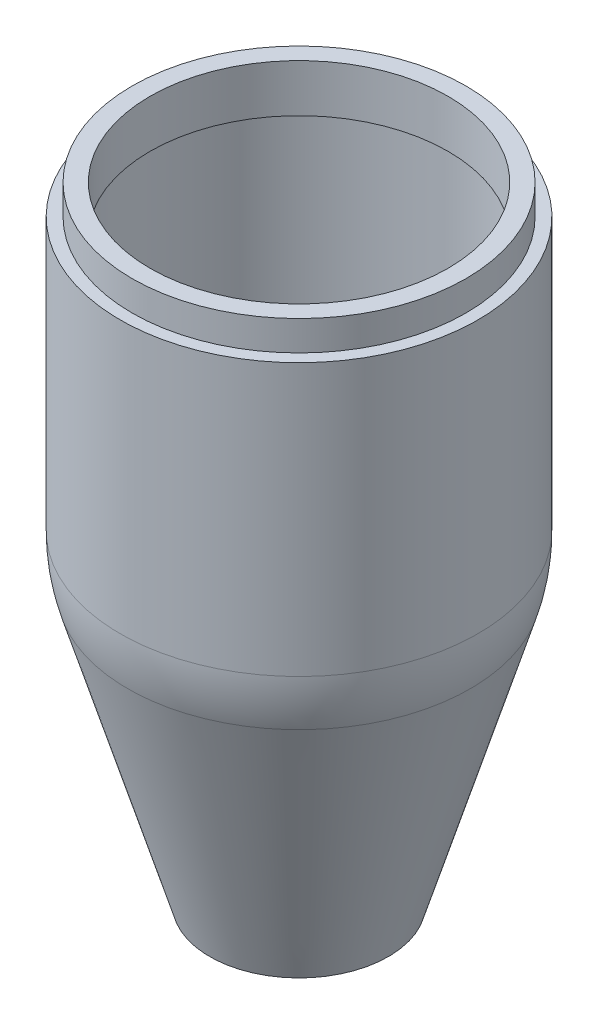
ISO-10303-21;
HEADER;
FILE_DESCRIPTION(('STEP AP214'),'2;1');
FILE_NAME('part.step','',(''),(''),'','','');
FILE_SCHEMA(('AUTOMOTIVE_DESIGN { 1 0 10303 214 1 1 1 1 }'));
ENDSEC;
DATA;
#1=APPLICATION_CONTEXT('core data for automotive mechanical design processes');
#2=APPLICATION_PROTOCOL_DEFINITION('international standard','automotive_design',2000,#1);
#3=PRODUCT_CONTEXT('',#1,'mechanical');
#4=PRODUCT('Part','Part','',(#3));
#5=PRODUCT_RELATED_PRODUCT_CATEGORY('part','',(#4));
#6=PRODUCT_DEFINITION_FORMATION('','',#4);
#7=PRODUCT_DEFINITION_CONTEXT('part definition',#1,'design');
#8=PRODUCT_DEFINITION('design','',#6,#7);
#9=PRODUCT_DEFINITION_SHAPE('','',#8);
#10=(LENGTH_UNIT() NAMED_UNIT(*) SI_UNIT(.MILLI.,.METRE.));
#11=(NAMED_UNIT(*) PLANE_ANGLE_UNIT() SI_UNIT($,.RADIAN.));
#12=(NAMED_UNIT(*) SI_UNIT($,.STERADIAN.) SOLID_ANGLE_UNIT());
#13=UNCERTAINTY_MEASURE_WITH_UNIT(LENGTH_MEASURE(1.E-05),#10,'distance_accuracy_value','');
#14=(GEOMETRIC_REPRESENTATION_CONTEXT(3) GLOBAL_UNCERTAINTY_ASSIGNED_CONTEXT((#13)) GLOBAL_UNIT_ASSIGNED_CONTEXT((#10,
#11,#12)) REPRESENTATION_CONTEXT('',''));
#15=CARTESIAN_POINT('',(0.,0.,0.));
#16=DIRECTION('',(0.,0.,1.));
#17=DIRECTION('',(1.,0.,0.));
#18=AXIS2_PLACEMENT_3D('',#15,#16,#17);
#19=CARTESIAN_POINT('',(0.,0.,0.));
#20=DIRECTION('',(0.,-1.,0.));
#21=DIRECTION('',(0.,0.,-1.));
#22=AXIS2_PLACEMENT_3D('',#19,#20,#21);
#23=PLANE('',#22);
#24=CARTESIAN_POINT('',(0.,0.,0.));
#25=DIRECTION('',(0.,-1.,0.));
#26=DIRECTION('',(0.,0.,-1.));
#27=AXIS2_PLACEMENT_3D('',#24,#25,#26);
#28=CIRCLE('',#27,15.);
#29=CARTESIAN_POINT('',(0.,0.,-15.));
#30=VERTEX_POINT('',#29);
#31=EDGE_CURVE('E55',#30,#30,#28,.T.);
#32=ORIENTED_EDGE('',*,*,#31,.T.);
#33=EDGE_LOOP('',(#32));
#34=FACE_BOUND('',#33,.T.);
#35=ADVANCED_FACE('F41',(#34),#23,.T.);
#36=CARTESIAN_POINT('',(0.,100.,0.));
#37=DIRECTION('',(0.,1.,0.));
#38=DIRECTION('',(0.,0.,1.));
#39=AXIS2_PLACEMENT_3D('',#36,#37,#38);
#40=PLANE('',#39);
#41=CARTESIAN_POINT('',(0.,100.,0.));
#42=DIRECTION('',(0.,1.,0.));
#43=DIRECTION('',(0.,0.,1.));
#44=AXIS2_PLACEMENT_3D('',#41,#42,#43);
#45=CIRCLE('',#44,28.);
#46=CARTESIAN_POINT('',(0.,100.,28.));
#47=VERTEX_POINT('',#46);
#48=EDGE_CURVE('E61',#47,#47,#45,.T.);
#49=ORIENTED_EDGE('',*,*,#48,.F.);
#50=EDGE_LOOP('',(#49));
#51=FACE_BOUND('',#50,.T.);
#52=CARTESIAN_POINT('',(0.,100.,0.));
#53=DIRECTION('',(0.,-1.,0.));
#54=DIRECTION('',(0.,0.,-1.));
#55=AXIS2_PLACEMENT_3D('',#52,#53,#54);
#56=CIRCLE('',#55,30.);
#57=CARTESIAN_POINT('',(0.,100.,-30.));
#58=VERTEX_POINT('',#57);
#59=EDGE_CURVE('E11',#58,#58,#56,.T.);
#60=ORIENTED_EDGE('',*,*,#59,.F.);
#61=EDGE_LOOP('',(#60));
#62=FACE_BOUND('',#61,.T.);
#63=ADVANCED_FACE('F103',(#51,#62),#40,.T.);
#64=CARTESIAN_POINT('',(0.,0.,0.));
#65=DIRECTION('',(0.,-1.,0.));
#66=DIRECTION('',(0.,0.,-1.));
#67=AXIS2_PLACEMENT_3D('',#64,#65,#66);
#68=CYLINDRICAL_SURFACE('',#67,30.);
#69=ORIENTED_EDGE('',*,*,#59,.T.);
#70=EDGE_LOOP('',(#69));
#71=FACE_BOUND('',#70,.T.);
#72=CARTESIAN_POINT('',(0.,54.4030650891056,0.));
#73=DIRECTION('',(0.,-1.,0.));
#74=DIRECTION('',(0.,0.,-1.));
#75=AXIS2_PLACEMENT_3D('',#72,#73,#74);
#76=CIRCLE('',#75,30.);
#77=CARTESIAN_POINT('',(0.,54.4030650891056,-30.));
#78=VERTEX_POINT('',#77);
#79=EDGE_CURVE('E47',#78,#78,#76,.T.);
#80=ORIENTED_EDGE('',*,*,#79,.F.);
#81=EDGE_LOOP('',(#80));
#82=FACE_BOUND('',#81,.T.);
#83=ADVANCED_FACE('F108',(#71,#82),#68,.T.);
#84=CARTESIAN_POINT('',(0.,54.4030650891055,0.));
#85=DIRECTION('',(0.,-1.,0.));
#86=DIRECTION('',(1.,0.,0.));
#87=AXIS2_PLACEMENT_3D('',#84,#85,#86);
#88=SPHERICAL_SURFACE('',#87,30.);
#89=ORIENTED_EDGE('',*,*,#79,.T.);
#90=EDGE_LOOP('',(#89));
#91=FACE_BOUND('',#90,.T.);
#92=CARTESIAN_POINT('',(0.,45.782628522115,0.));
#93=DIRECTION('',(0.,-1.,0.));
#94=DIRECTION('',(0.,0.,-1.));
#95=AXIS2_PLACEMENT_3D('',#92,#93,#94);
#96=CIRCLE('',#95,28.7347885566345);
#97=CARTESIAN_POINT('',(0.,45.782628522115,-28.7347885566345));
#98=VERTEX_POINT('',#97);
#99=EDGE_CURVE('E51',#98,#98,#96,.T.);
#100=ORIENTED_EDGE('',*,*,#99,.F.);
#101=EDGE_LOOP('',(#100));
#102=FACE_BOUND('',#101,.T.);
#103=ADVANCED_FACE('F115',(#91,#102),#88,.T.);
#104=CARTESIAN_POINT('',(0.,0.,0.));
#105=DIRECTION('',(0.,1.,0.));
#106=DIRECTION('',(0.,0.,1.));
#107=AXIS2_PLACEMENT_3D('',#104,#105,#106);
#108=CONICAL_SURFACE('',#107,15.,0.291456794477867);
#109=ORIENTED_EDGE('',*,*,#99,.T.);
#110=EDGE_LOOP('',(#109));
#111=FACE_BOUND('',#110,.T.);
#112=ORIENTED_EDGE('',*,*,#31,.F.);
#113=EDGE_LOOP('',(#112));
#114=FACE_BOUND('',#113,.T.);
#115=ADVANCED_FACE('F112',(#111,#114),#108,.T.);
#116=CARTESIAN_POINT('',(0.,105.,0.));
#117=DIRECTION('',(0.,1.,0.));
#118=DIRECTION('',(0.,0.,1.));
#119=AXIS2_PLACEMENT_3D('',#116,#117,#118);
#120=PLANE('',#119);
#121=CARTESIAN_POINT('',(0.,105.,0.));
#122=DIRECTION('',(0.,1.,0.));
#123=DIRECTION('',(0.,0.,1.));
#124=AXIS2_PLACEMENT_3D('',#121,#122,#123);
#125=CIRCLE('',#124,28.);
#126=CARTESIAN_POINT('',(0.,105.,28.));
#127=VERTEX_POINT('',#126);
#128=EDGE_CURVE('E60',#127,#127,#125,.T.);
#129=ORIENTED_EDGE('',*,*,#128,.T.);
#130=EDGE_LOOP('',(#129));
#131=FACE_BOUND('',#130,.T.);
#132=CARTESIAN_POINT('',(0.,105.,0.));
#133=DIRECTION('',(0.,1.,0.));
#134=DIRECTION('',(1.,0.,0.));
#135=AXIS2_PLACEMENT_3D('',#132,#133,#134);
#136=CIRCLE('',#135,25.);
#137=CARTESIAN_POINT('',(25.,105.,0.));
#138=VERTEX_POINT('',#137);
#139=EDGE_CURVE('E64',#138,#138,#136,.T.);
#140=ORIENTED_EDGE('',*,*,#139,.F.);
#141=EDGE_LOOP('',(#140));
#142=FACE_BOUND('',#141,.T.);
#143=ADVANCED_FACE('F114',(#131,#142),#120,.T.);
#144=CARTESIAN_POINT('',(0.,105.,0.));
#145=DIRECTION('',(0.,-1.,0.));
#146=DIRECTION('',(0.,0.,-1.));
#147=AXIS2_PLACEMENT_3D('',#144,#145,#146);
#148=CYLINDRICAL_SURFACE('',#147,28.);
#149=ORIENTED_EDGE('',*,*,#128,.F.);
#150=EDGE_LOOP('',(#149));
#151=FACE_BOUND('',#150,.T.);
#152=ORIENTED_EDGE('',*,*,#48,.T.);
#153=EDGE_LOOP('',(#152));
#154=FACE_BOUND('',#153,.T.);
#155=ADVANCED_FACE('F99',(#151,#154),#148,.T.);
#156=CARTESIAN_POINT('',(0.,105.,0.));
#157=DIRECTION('',(0.,-1.,0.));
#158=DIRECTION('',(0.,0.,-1.));
#159=AXIS2_PLACEMENT_3D('',#156,#157,#158);
#160=CYLINDRICAL_SURFACE('',#159,25.);
#161=ORIENTED_EDGE('',*,*,#139,.T.);
#162=EDGE_LOOP('',(#161));
#163=FACE_BOUND('',#162,.T.);
#164=CARTESIAN_POINT('',(0.,97.,0.));
#165=DIRECTION('',(0.,1.,0.));
#166=DIRECTION('',(0.,0.,1.));
#167=AXIS2_PLACEMENT_3D('',#164,#165,#166);
#168=CIRCLE('',#167,25.);
#169=CARTESIAN_POINT('',(0.,97.,25.));
#170=VERTEX_POINT('',#169);
#171=EDGE_CURVE('E70',#170,#170,#168,.T.);
#172=ORIENTED_EDGE('',*,*,#171,.F.);
#173=EDGE_LOOP('',(#172));
#174=FACE_BOUND('',#173,.T.);
#175=ADVANCED_FACE('F90',(#163,#174),#160,.F.);
#176=CARTESIAN_POINT('',(0.,3.,0.));
#177=DIRECTION('',(0.,-1.,0.));
#178=DIRECTION('',(0.,0.,-1.));
#179=AXIS2_PLACEMENT_3D('',#176,#177,#178);
#180=PLANE('',#179);
#181=CARTESIAN_POINT('',(0.,3.,0.));
#182=DIRECTION('',(0.,-1.,0.));
#183=DIRECTION('',(0.,0.,-1.));
#184=AXIS2_PLACEMENT_3D('',#181,#182,#183);
#185=CIRCLE('',#184,12.7679080473268);
#186=CARTESIAN_POINT('',(0.,3.,-12.7679080473268));
#187=VERTEX_POINT('',#186);
#188=EDGE_CURVE('E73',#187,#187,#185,.T.);
#189=ORIENTED_EDGE('',*,*,#188,.F.);
#190=EDGE_LOOP('',(#189));
#191=FACE_BOUND('',#190,.T.);
#192=ADVANCED_FACE('F87',(#191),#180,.F.);
#193=CARTESIAN_POINT('',(0.,97.,0.));
#194=DIRECTION('',(0.,1.,0.));
#195=DIRECTION('',(0.,0.,1.));
#196=AXIS2_PLACEMENT_3D('',#193,#194,#195);
#197=PLANE('',#196);
#198=ORIENTED_EDGE('',*,*,#171,.T.);
#199=EDGE_LOOP('',(#198));
#200=FACE_BOUND('',#199,.T.);
#201=CARTESIAN_POINT('',(0.,97.,0.));
#202=DIRECTION('',(0.,1.,0.));
#203=DIRECTION('',(0.,0.,1.));
#204=AXIS2_PLACEMENT_3D('',#201,#202,#203);
#205=CIRCLE('',#204,27.);
#206=CARTESIAN_POINT('',(0.,97.,27.));
#207=VERTEX_POINT('',#206);
#208=EDGE_CURVE('E69',#207,#207,#205,.F.);
#209=ORIENTED_EDGE('',*,*,#208,.T.);
#210=EDGE_LOOP('',(#209));
#211=FACE_BOUND('',#210,.T.);
#212=ADVANCED_FACE('F89',(#200,#211),#197,.F.);
#213=CARTESIAN_POINT('',(0.,0.,0.));
#214=DIRECTION('',(0.,-1.,0.));
#215=DIRECTION('',(0.,0.,-1.));
#216=AXIS2_PLACEMENT_3D('',#213,#214,#215);
#217=CYLINDRICAL_SURFACE('',#216,27.);
#218=ORIENTED_EDGE('',*,*,#208,.F.);
#219=EDGE_LOOP('',(#218));
#220=FACE_BOUND('',#219,.T.);
#221=CARTESIAN_POINT('',(0.,54.4030650891056,0.));
#222=DIRECTION('',(0.,-1.,0.));
#223=DIRECTION('',(0.,0.,-1.));
#224=AXIS2_PLACEMENT_3D('',#221,#222,#223);
#225=CIRCLE('',#224,27.);
#226=CARTESIAN_POINT('',(0.,54.4030650891056,-27.));
#227=VERTEX_POINT('',#226);
#228=EDGE_CURVE('E76',#227,#227,#225,.T.);
#229=ORIENTED_EDGE('',*,*,#228,.T.);
#230=EDGE_LOOP('',(#229));
#231=FACE_BOUND('',#230,.T.);
#232=ADVANCED_FACE('F96',(#220,#231),#217,.F.);
#233=CARTESIAN_POINT('',(0.,54.4030650891055,0.));
#234=DIRECTION('',(0.,-1.,0.));
#235=DIRECTION('',(1.,0.,0.));
#236=AXIS2_PLACEMENT_3D('',#233,#234,#235);
#237=SPHERICAL_SURFACE('',#236,27.);
#238=ORIENTED_EDGE('',*,*,#228,.F.);
#239=EDGE_LOOP('',(#238));
#240=FACE_BOUND('',#239,.T.);
#241=CARTESIAN_POINT('',(0.,46.6446721788141,0.));
#242=DIRECTION('',(0.,1.,0.));
#243=DIRECTION('',(0.,0.,1.));
#244=AXIS2_PLACEMENT_3D('',#241,#242,#243);
#245=CIRCLE('',#244,25.8613097009711);
#246=CARTESIAN_POINT('',(0.,46.6446721788141,25.8613097009711));
#247=VERTEX_POINT('',#246);
#248=EDGE_CURVE('E79',#247,#247,#245,.F.);
#249=ORIENTED_EDGE('',*,*,#248,.T.);
#250=EDGE_LOOP('',(#249));
#251=FACE_BOUND('',#250,.T.);
#252=ADVANCED_FACE('F193',(#240,#251),#237,.F.);
#253=CARTESIAN_POINT('',(0.,0.862043656699037,0.));
#254=DIRECTION('',(0.,1.,0.));
#255=DIRECTION('',(0.,0.,1.));
#256=AXIS2_PLACEMENT_3D('',#253,#254,#255);
#257=CONICAL_SURFACE('',#256,12.1265211443365,0.291456794477867);
#258=ORIENTED_EDGE('',*,*,#248,.F.);
#259=EDGE_LOOP('',(#258));
#260=FACE_BOUND('',#259,.T.);
#261=ORIENTED_EDGE('',*,*,#188,.T.);
#262=EDGE_LOOP('',(#261));
#263=FACE_BOUND('',#262,.T.);
#264=ADVANCED_FACE('F85',(#260,#263),#257,.F.);
#265=CLOSED_SHELL('',(#35,#63,#83,#103,#115,#143,#155,#175,#192,#212,#232,#252,#264));
#266=MANIFOLD_SOLID_BREP('B2',#265);
#267=ADVANCED_BREP_SHAPE_REPRESENTATION('',(#18,#266),#14);
#268=SHAPE_DEFINITION_REPRESENTATION(#9,#267);
ENDSEC;
END-ISO-10303-21;
